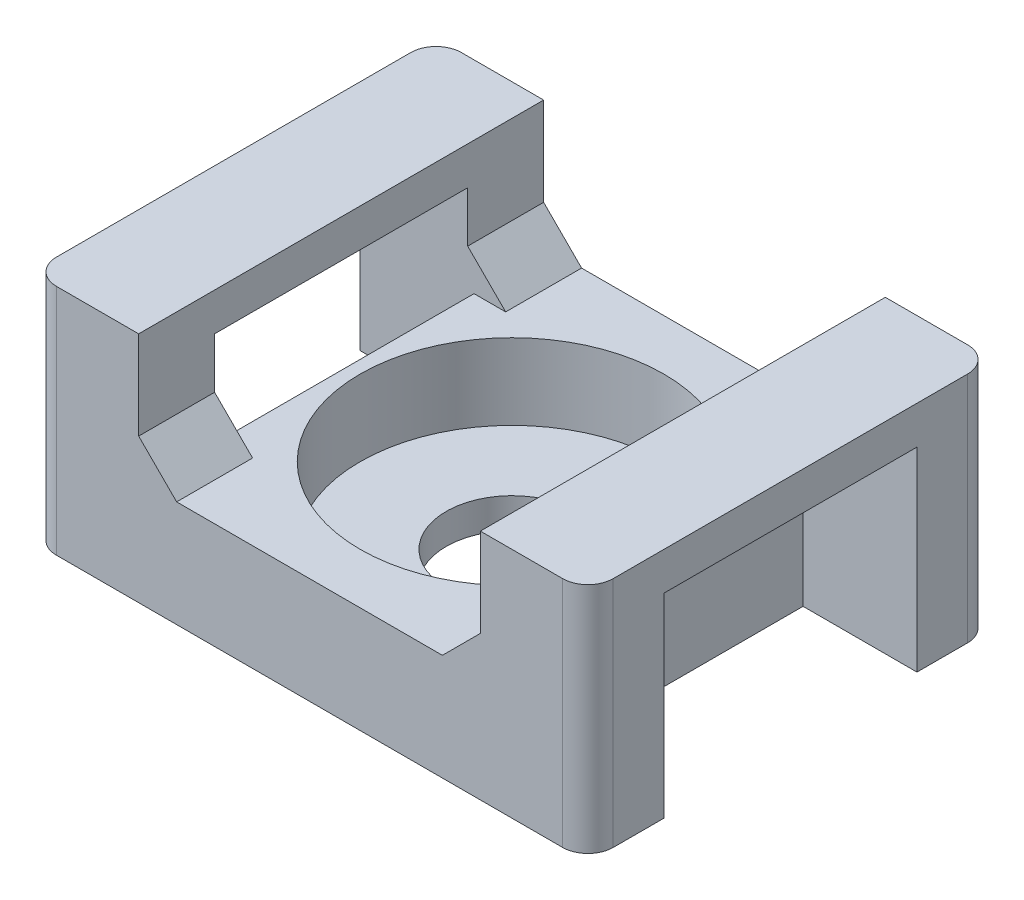
ISO-10303-21;
HEADER;
FILE_DESCRIPTION(('STEP AP214'),'2;1');
FILE_NAME('part.step','',(''),(''),'','','');
FILE_SCHEMA(('AUTOMOTIVE_DESIGN { 1 0 10303 214 1 1 1 1 }'));
ENDSEC;
DATA;
#1=APPLICATION_CONTEXT('core data for automotive mechanical design processes');
#2=APPLICATION_PROTOCOL_DEFINITION('international standard','automotive_design',2000,#1);
#3=PRODUCT_CONTEXT('',#1,'mechanical');
#4=PRODUCT('Part','Part','',(#3));
#5=PRODUCT_RELATED_PRODUCT_CATEGORY('part','',(#4));
#6=PRODUCT_DEFINITION_FORMATION('','',#4);
#7=PRODUCT_DEFINITION_CONTEXT('part definition',#1,'design');
#8=PRODUCT_DEFINITION('design','',#6,#7);
#9=PRODUCT_DEFINITION_SHAPE('','',#8);
#10=(LENGTH_UNIT() NAMED_UNIT(*) SI_UNIT(.MILLI.,.METRE.));
#11=(NAMED_UNIT(*) PLANE_ANGLE_UNIT() SI_UNIT($,.RADIAN.));
#12=(NAMED_UNIT(*) SI_UNIT($,.STERADIAN.) SOLID_ANGLE_UNIT());
#13=UNCERTAINTY_MEASURE_WITH_UNIT(LENGTH_MEASURE(1.E-05),#10,'distance_accuracy_value','');
#14=(GEOMETRIC_REPRESENTATION_CONTEXT(3) GLOBAL_UNCERTAINTY_ASSIGNED_CONTEXT((#13)) GLOBAL_UNIT_ASSIGNED_CONTEXT((#10,
#11,#12)) REPRESENTATION_CONTEXT('',''));
#15=CARTESIAN_POINT('',(0.,0.,0.));
#16=DIRECTION('',(0.,0.,1.));
#17=DIRECTION('',(1.,0.,0.));
#18=AXIS2_PLACEMENT_3D('',#15,#16,#17);
#19=CARTESIAN_POINT('',(-5.25,4.2,8.));
#20=DIRECTION('',(0.,-1.,0.));
#21=DIRECTION('',(1.,0.,0.));
#22=AXIS2_PLACEMENT_3D('',#19,#20,#21);
#23=PLANE('',#22);
#24=DIRECTION('',(-1.,0.,0.));
#25=VECTOR('',#24,1.);
#26=CARTESIAN_POINT('',(-5.25,4.2,-8.));
#27=LINE('',#26,#25);
#28=CARTESIAN_POINT('',(5.25,4.2,-8.));
#29=VERTEX_POINT('',#28);
#30=CARTESIAN_POINT('',(-5.25,4.2,-8.));
#31=VERTEX_POINT('',#30);
#32=EDGE_CURVE('E336',#29,#31,#27,.T.);
#33=ORIENTED_EDGE('',*,*,#32,.T.);
#34=DIRECTION('',(0.,0.,-1.));
#35=VECTOR('',#34,1.);
#36=CARTESIAN_POINT('',(-5.25,4.2,8.));
#37=LINE('',#36,#35);
#38=CARTESIAN_POINT('',(-5.25,4.2,-5.));
#39=VERTEX_POINT('',#38);
#40=EDGE_CURVE('E353',#39,#31,#37,.T.);
#41=ORIENTED_EDGE('',*,*,#40,.F.);
#42=DIRECTION('',(1.,0.,0.));
#43=VECTOR('',#42,1.);
#44=CARTESIAN_POINT('',(-5.25,4.2,-5.));
#45=LINE('',#44,#43);
#46=CARTESIAN_POINT('',(-6.5,4.2,-5.));
#47=VERTEX_POINT('',#46);
#48=EDGE_CURVE('E265',#47,#39,#45,.T.);
#49=ORIENTED_EDGE('',*,*,#48,.F.);
#50=DIRECTION('',(0.,0.,1.));
#51=VECTOR('',#50,1.);
#52=CARTESIAN_POINT('',(-6.5,4.2,-5.));
#53=LINE('',#52,#51);
#54=CARTESIAN_POINT('',(-6.5,4.2,5.));
#55=VERTEX_POINT('',#54);
#56=EDGE_CURVE('E303',#47,#55,#53,.T.);
#57=ORIENTED_EDGE('',*,*,#56,.T.);
#58=DIRECTION('',(1.,0.,0.));
#59=VECTOR('',#58,1.);
#60=CARTESIAN_POINT('',(-5.25,4.2,5.));
#61=LINE('',#60,#59);
#62=CARTESIAN_POINT('',(-5.25,4.2,5.));
#63=VERTEX_POINT('',#62);
#64=EDGE_CURVE('E285',#55,#63,#61,.T.);
#65=ORIENTED_EDGE('',*,*,#64,.T.);
#66=CARTESIAN_POINT('',(-5.25,4.2,8.));
#67=VERTEX_POINT('',#66);
#68=EDGE_CURVE('E354',#67,#63,#37,.T.);
#69=ORIENTED_EDGE('',*,*,#68,.F.);
#70=DIRECTION('',(-1.,0.,0.));
#71=VECTOR('',#70,1.);
#72=CARTESIAN_POINT('',(-5.25,4.2,8.));
#73=LINE('',#72,#71);
#74=CARTESIAN_POINT('',(5.25,4.2,8.));
#75=VERTEX_POINT('',#74);
#76=EDGE_CURVE('E317',#75,#67,#73,.T.);
#77=ORIENTED_EDGE('',*,*,#76,.F.);
#78=DIRECTION('',(0.,0.,-1.));
#79=VECTOR('',#78,1.);
#80=CARTESIAN_POINT('',(5.25,4.2,8.));
#81=LINE('',#80,#79);
#82=CARTESIAN_POINT('',(5.25,4.2,5.));
#83=VERTEX_POINT('',#82);
#84=EDGE_CURVE('E358',#75,#83,#81,.T.);
#85=ORIENTED_EDGE('',*,*,#84,.T.);
#86=DIRECTION('',(-1.,0.,0.));
#87=VECTOR('',#86,1.);
#88=CARTESIAN_POINT('',(5.25,4.2,5.));
#89=LINE('',#88,#87);
#90=CARTESIAN_POINT('',(6.5,4.2,5.));
#91=VERTEX_POINT('',#90);
#92=EDGE_CURVE('E534',#91,#83,#89,.T.);
#93=ORIENTED_EDGE('',*,*,#92,.F.);
#94=DIRECTION('',(0.,0.,1.));
#95=VECTOR('',#94,1.);
#96=CARTESIAN_POINT('',(6.5,4.2,-5.));
#97=LINE('',#96,#95);
#98=CARTESIAN_POINT('',(6.5,4.2,-5.));
#99=VERTEX_POINT('',#98);
#100=EDGE_CURVE('E250',#99,#91,#97,.T.);
#101=ORIENTED_EDGE('',*,*,#100,.F.);
#102=DIRECTION('',(-1.,0.,0.));
#103=VECTOR('',#102,1.);
#104=CARTESIAN_POINT('',(5.25,4.2,-5.));
#105=LINE('',#104,#103);
#106=CARTESIAN_POINT('',(5.25,4.2,-5.));
#107=VERTEX_POINT('',#106);
#108=EDGE_CURVE('E550',#99,#107,#105,.T.);
#109=ORIENTED_EDGE('',*,*,#108,.T.);
#110=EDGE_CURVE('E357',#107,#29,#81,.T.);
#111=ORIENTED_EDGE('',*,*,#110,.T.);
#112=EDGE_LOOP('',(#33,#41,#49,#57,#65,#69,#77,#85,#93,#101,#109,#111));
#113=FACE_BOUND('',#112,.T.);
#114=CARTESIAN_POINT('',(0.,4.2,0.));
#115=DIRECTION('',(0.,1.,0.));
#116=DIRECTION('',(0.,0.,1.));
#117=AXIS2_PLACEMENT_3D('',#114,#115,#116);
#118=CIRCLE('',#117,6.);
#119=CARTESIAN_POINT('',(0.,4.2,6.));
#120=VERTEX_POINT('',#119);
#121=EDGE_CURVE('E564',#120,#120,#118,.T.);
#122=ORIENTED_EDGE('',*,*,#121,.F.);
#123=EDGE_LOOP('',(#122));
#124=FACE_BOUND('',#123,.T.);
#125=ADVANCED_FACE('F35',(#113,#124),#23,.F.);
#126=CARTESIAN_POINT('',(6.75,5.70000000000001,8.));
#127=DIRECTION('',(0.707106781186549,-0.707106781186546,0.));
#128=DIRECTION('',(0.707106781186546,0.707106781186549,0.));
#129=AXIS2_PLACEMENT_3D('',#126,#127,#128);
#130=PLANE('',#129);
#131=DIRECTION('',(0.707106781186546,0.707106781186549,0.));
#132=VECTOR('',#131,1.);
#133=CARTESIAN_POINT('',(6.75,5.70000000000001,5.));
#134=LINE('',#133,#132);
#135=CARTESIAN_POINT('',(6.75,5.70000000000001,5.));
#136=VERTEX_POINT('',#135);
#137=EDGE_CURVE('E440',#83,#136,#134,.T.);
#138=ORIENTED_EDGE('',*,*,#137,.F.);
#139=ORIENTED_EDGE('',*,*,#84,.F.);
#140=DIRECTION('',(-0.707106781186546,-0.707106781186549,0.));
#141=VECTOR('',#140,1.);
#142=CARTESIAN_POINT('',(6.75,5.70000000000001,8.));
#143=LINE('',#142,#141);
#144=CARTESIAN_POINT('',(6.75,5.70000000000001,8.));
#145=VERTEX_POINT('',#144);
#146=EDGE_CURVE('E315',#145,#75,#143,.T.);
#147=ORIENTED_EDGE('',*,*,#146,.F.);
#148=DIRECTION('',(0.,0.,-1.));
#149=VECTOR('',#148,1.);
#150=CARTESIAN_POINT('',(6.75,5.70000000000001,8.));
#151=LINE('',#150,#149);
#152=EDGE_CURVE('E362',#145,#136,#151,.T.);
#153=ORIENTED_EDGE('',*,*,#152,.T.);
#154=EDGE_LOOP('',(#138,#139,#147,#153));
#155=FACE_BOUND('',#154,.T.);
#156=ADVANCED_FACE('F439',(#155),#130,.F.);
#157=CARTESIAN_POINT('',(-6.75,5.70000000000001,8.));
#158=DIRECTION('',(-0.707106781186549,-0.707106781186546,0.));
#159=DIRECTION('',(0.707106781186546,-0.707106781186549,0.));
#160=AXIS2_PLACEMENT_3D('',#157,#158,#159);
#161=PLANE('',#160);
#162=DIRECTION('',(-0.707106781186546,0.707106781186549,0.));
#163=VECTOR('',#162,1.);
#164=CARTESIAN_POINT('',(-6.75,5.70000000000001,5.));
#165=LINE('',#164,#163);
#166=CARTESIAN_POINT('',(-6.75,5.70000000000001,5.));
#167=VERTEX_POINT('',#166);
#168=EDGE_CURVE('E288',#63,#167,#165,.T.);
#169=ORIENTED_EDGE('',*,*,#168,.T.);
#170=DIRECTION('',(0.,0.,-1.));
#171=VECTOR('',#170,1.);
#172=CARTESIAN_POINT('',(-6.75,5.70000000000001,8.));
#173=LINE('',#172,#171);
#174=CARTESIAN_POINT('',(-6.75,5.70000000000001,8.));
#175=VERTEX_POINT('',#174);
#176=EDGE_CURVE('E350',#175,#167,#173,.T.);
#177=ORIENTED_EDGE('',*,*,#176,.F.);
#178=DIRECTION('',(-0.707106781186546,0.707106781186549,0.));
#179=VECTOR('',#178,1.);
#180=CARTESIAN_POINT('',(-6.75,5.70000000000001,8.));
#181=LINE('',#180,#179);
#182=EDGE_CURVE('E319',#67,#175,#181,.T.);
#183=ORIENTED_EDGE('',*,*,#182,.F.);
#184=ORIENTED_EDGE('',*,*,#68,.T.);
#185=EDGE_LOOP('',(#169,#177,#183,#184));
#186=FACE_BOUND('',#185,.T.);
#187=ADVANCED_FACE('F448',(#186),#161,.F.);
#188=CARTESIAN_POINT('',(-11.,0.,8.));
#189=DIRECTION('',(1.,0.,0.));
#190=DIRECTION('',(0.,0.,-1.));
#191=AXIS2_PLACEMENT_3D('',#188,#189,#190);
#192=PLANE('',#191);
#193=DIRECTION('',(0.,0.,-1.));
#194=VECTOR('',#193,1.);
#195=CARTESIAN_POINT('',(-11.,9.2,8.));
#196=LINE('',#195,#194);
#197=CARTESIAN_POINT('',(-11.,9.2,7.));
#198=VERTEX_POINT('',#197);
#199=CARTESIAN_POINT('',(-11.,9.2,-7.));
#200=VERTEX_POINT('',#199);
#201=EDGE_CURVE('E325',#198,#200,#196,.T.);
#202=ORIENTED_EDGE('',*,*,#201,.T.);
#203=DIRECTION('',(0.,-1.,0.));
#204=VECTOR('',#203,1.);
#205=CARTESIAN_POINT('',(-11.,0.,-7.));
#206=LINE('',#205,#204);
#207=CARTESIAN_POINT('',(-11.,0.,-7.));
#208=VERTEX_POINT('',#207);
#209=EDGE_CURVE('E400',#200,#208,#206,.T.);
#210=ORIENTED_EDGE('',*,*,#209,.T.);
#211=DIRECTION('',(0.,0.,-1.));
#212=VECTOR('',#211,1.);
#213=CARTESIAN_POINT('',(-11.,0.,8.));
#214=LINE('',#213,#212);
#215=CARTESIAN_POINT('',(-11.,0.,-5.));
#216=VERTEX_POINT('',#215);
#217=EDGE_CURVE('E374',#216,#208,#214,.T.);
#218=ORIENTED_EDGE('',*,*,#217,.F.);
#219=DIRECTION('',(0.,-1.,0.));
#220=VECTOR('',#219,1.);
#221=CARTESIAN_POINT('',(-11.,0.,-5.));
#222=LINE('',#221,#220);
#223=CARTESIAN_POINT('',(-11.,7.7,-5.));
#224=VERTEX_POINT('',#223);
#225=EDGE_CURVE('E256',#224,#216,#222,.T.);
#226=ORIENTED_EDGE('',*,*,#225,.F.);
#227=DIRECTION('',(0.,0.,1.));
#228=VECTOR('',#227,1.);
#229=CARTESIAN_POINT('',(-11.,7.7,-5.));
#230=LINE('',#229,#228);
#231=CARTESIAN_POINT('',(-11.,7.7,5.));
#232=VERTEX_POINT('',#231);
#233=EDGE_CURVE('E296',#224,#232,#230,.T.);
#234=ORIENTED_EDGE('',*,*,#233,.T.);
#235=DIRECTION('',(0.,-1.,0.));
#236=VECTOR('',#235,1.);
#237=CARTESIAN_POINT('',(-11.,0.,5.));
#238=LINE('',#237,#236);
#239=CARTESIAN_POINT('',(-11.,0.,5.));
#240=VERTEX_POINT('',#239);
#241=EDGE_CURVE('E275',#232,#240,#238,.T.);
#242=ORIENTED_EDGE('',*,*,#241,.T.);
#243=CARTESIAN_POINT('',(-11.,0.,7.));
#244=VERTEX_POINT('',#243);
#245=EDGE_CURVE('E375',#244,#240,#214,.T.);
#246=ORIENTED_EDGE('',*,*,#245,.F.);
#247=DIRECTION('',(0.,-1.,0.));
#248=VECTOR('',#247,1.);
#249=CARTESIAN_POINT('',(-11.,0.,7.));
#250=LINE('',#249,#248);
#251=EDGE_CURVE('E398',#244,#198,#250,.F.);
#252=ORIENTED_EDGE('',*,*,#251,.T.);
#253=EDGE_LOOP('',(#202,#210,#218,#226,#234,#242,#246,#252));
#254=FACE_BOUND('',#253,.T.);
#255=ADVANCED_FACE('F487',(#254),#192,.F.);
#256=CARTESIAN_POINT('',(11.,0.,8.));
#257=DIRECTION('',(0.,1.,0.));
#258=DIRECTION('',(0.,0.,1.));
#259=AXIS2_PLACEMENT_3D('',#256,#257,#258);
#260=PLANE('',#259);
#261=CARTESIAN_POINT('',(0.,0.,0.));
#262=DIRECTION('',(0.,1.,0.));
#263=DIRECTION('',(0.,0.,1.));
#264=AXIS2_PLACEMENT_3D('',#261,#262,#263);
#265=CIRCLE('',#264,2.6);
#266=CARTESIAN_POINT('',(0.,0.,2.6));
#267=VERTEX_POINT('',#266);
#268=EDGE_CURVE('E529',#267,#267,#265,.T.);
#269=ORIENTED_EDGE('',*,*,#268,.T.);
#270=EDGE_LOOP('',(#269));
#271=FACE_BOUND('',#270,.T.);
#272=DIRECTION('',(1.,0.,0.));
#273=VECTOR('',#272,1.);
#274=CARTESIAN_POINT('',(11.,0.,-8.));
#275=LINE('',#274,#273);
#276=CARTESIAN_POINT('',(-10.,0.,-8.));
#277=VERTEX_POINT('',#276);
#278=CARTESIAN_POINT('',(10.,0.,-8.));
#279=VERTEX_POINT('',#278);
#280=EDGE_CURVE('E299',#277,#279,#275,.T.);
#281=ORIENTED_EDGE('',*,*,#280,.T.);
#282=CARTESIAN_POINT('',(10.,0.,-7.));
#283=DIRECTION('',(0.,1.,0.));
#284=DIRECTION('',(0.,0.,1.));
#285=AXIS2_PLACEMENT_3D('',#282,#283,#284);
#286=CIRCLE('',#285,1.);
#287=CARTESIAN_POINT('',(11.,0.,-7.));
#288=VERTEX_POINT('',#287);
#289=EDGE_CURVE('E396',#279,#288,#286,.F.);
#290=ORIENTED_EDGE('',*,*,#289,.T.);
#291=DIRECTION('',(0.,0.,-1.));
#292=VECTOR('',#291,1.);
#293=CARTESIAN_POINT('',(11.,0.,8.));
#294=LINE('',#293,#292);
#295=CARTESIAN_POINT('',(11.,0.,-5.));
#296=VERTEX_POINT('',#295);
#297=EDGE_CURVE('E371',#296,#288,#294,.T.);
#298=ORIENTED_EDGE('',*,*,#297,.F.);
#299=DIRECTION('',(-1.,0.,0.));
#300=VECTOR('',#299,1.);
#301=CARTESIAN_POINT('',(6.5,0.,-5.));
#302=LINE('',#301,#300);
#303=CARTESIAN_POINT('',(6.5,0.,-5.));
#304=VERTEX_POINT('',#303);
#305=EDGE_CURVE('E239',#296,#304,#302,.T.);
#306=ORIENTED_EDGE('',*,*,#305,.T.);
#307=DIRECTION('',(0.,0.,1.));
#308=VECTOR('',#307,1.);
#309=CARTESIAN_POINT('',(6.5,0.,-5.));
#310=LINE('',#309,#308);
#311=CARTESIAN_POINT('',(6.5,0.,5.));
#312=VERTEX_POINT('',#311);
#313=EDGE_CURVE('E279',#304,#312,#310,.T.);
#314=ORIENTED_EDGE('',*,*,#313,.T.);
#315=DIRECTION('',(-1.,0.,0.));
#316=VECTOR('',#315,1.);
#317=CARTESIAN_POINT('',(6.5,0.,5.));
#318=LINE('',#317,#316);
#319=CARTESIAN_POINT('',(11.,0.,5.));
#320=VERTEX_POINT('',#319);
#321=EDGE_CURVE('E243',#320,#312,#318,.T.);
#322=ORIENTED_EDGE('',*,*,#321,.F.);
#323=CARTESIAN_POINT('',(11.,0.,7.));
#324=VERTEX_POINT('',#323);
#325=EDGE_CURVE('E372',#324,#320,#294,.T.);
#326=ORIENTED_EDGE('',*,*,#325,.F.);
#327=CARTESIAN_POINT('',(10.,0.,7.));
#328=DIRECTION('',(0.,1.,0.));
#329=DIRECTION('',(0.,0.,1.));
#330=AXIS2_PLACEMENT_3D('',#327,#328,#329);
#331=CIRCLE('',#330,1.);
#332=CARTESIAN_POINT('',(10.,0.,8.));
#333=VERTEX_POINT('',#332);
#334=EDGE_CURVE('E392',#324,#333,#331,.F.);
#335=ORIENTED_EDGE('',*,*,#334,.T.);
#336=DIRECTION('',(1.,0.,0.));
#337=VECTOR('',#336,1.);
#338=CARTESIAN_POINT('',(11.,0.,8.));
#339=LINE('',#338,#337);
#340=CARTESIAN_POINT('',(-10.,0.,8.));
#341=VERTEX_POINT('',#340);
#342=EDGE_CURVE('E307',#341,#333,#339,.T.);
#343=ORIENTED_EDGE('',*,*,#342,.F.);
#344=CARTESIAN_POINT('',(-10.,0.,7.));
#345=DIRECTION('',(0.,1.,0.));
#346=DIRECTION('',(0.,0.,1.));
#347=AXIS2_PLACEMENT_3D('',#344,#345,#346);
#348=CIRCLE('',#347,1.);
#349=EDGE_CURVE('E390',#341,#244,#348,.F.);
#350=ORIENTED_EDGE('',*,*,#349,.T.);
#351=ORIENTED_EDGE('',*,*,#245,.T.);
#352=DIRECTION('',(1.,0.,0.));
#353=VECTOR('',#352,1.);
#354=CARTESIAN_POINT('',(-6.5,0.,5.));
#355=LINE('',#354,#353);
#356=CARTESIAN_POINT('',(-6.5,0.,5.));
#357=VERTEX_POINT('',#356);
#358=EDGE_CURVE('E278',#240,#357,#355,.T.);
#359=ORIENTED_EDGE('',*,*,#358,.T.);
#360=DIRECTION('',(0.,0.,1.));
#361=VECTOR('',#360,1.);
#362=CARTESIAN_POINT('',(-6.5,0.,-5.));
#363=LINE('',#362,#361);
#364=CARTESIAN_POINT('',(-6.5,0.,-5.));
#365=VERTEX_POINT('',#364);
#366=EDGE_CURVE('E274',#365,#357,#363,.T.);
#367=ORIENTED_EDGE('',*,*,#366,.F.);
#368=DIRECTION('',(1.,0.,0.));
#369=VECTOR('',#368,1.);
#370=CARTESIAN_POINT('',(-6.5,0.,-5.));
#371=LINE('',#370,#369);
#372=EDGE_CURVE('E258',#216,#365,#371,.T.);
#373=ORIENTED_EDGE('',*,*,#372,.F.);
#374=ORIENTED_EDGE('',*,*,#217,.T.);
#375=CARTESIAN_POINT('',(-10.,0.,-7.));
#376=DIRECTION('',(0.,1.,0.));
#377=DIRECTION('',(0.,0.,1.));
#378=AXIS2_PLACEMENT_3D('',#375,#376,#377);
#379=CIRCLE('',#378,1.);
#380=EDGE_CURVE('E394',#208,#277,#379,.F.);
#381=ORIENTED_EDGE('',*,*,#380,.T.);
#382=EDGE_LOOP('',(#281,#290,#298,#306,#314,#322,#326,#335,#343,#350,#351,#359,#367,#373,#374,#381));
#383=FACE_BOUND('',#382,.T.);
#384=ADVANCED_FACE('F412',(#271,#383),#260,.F.);
#385=CARTESIAN_POINT('',(11.,0.,8.));
#386=DIRECTION('',(-1.,0.,0.));
#387=DIRECTION('',(0.,0.,1.));
#388=AXIS2_PLACEMENT_3D('',#385,#386,#387);
#389=PLANE('',#388);
#390=ORIENTED_EDGE('',*,*,#297,.T.);
#391=DIRECTION('',(0.,1.,0.));
#392=VECTOR('',#391,1.);
#393=CARTESIAN_POINT('',(11.,9.2,-7.));
#394=LINE('',#393,#392);
#395=CARTESIAN_POINT('',(11.,9.2,-7.));
#396=VERTEX_POINT('',#395);
#397=EDGE_CURVE('E379',#288,#396,#394,.T.);
#398=ORIENTED_EDGE('',*,*,#397,.T.);
#399=DIRECTION('',(0.,0.,-1.));
#400=VECTOR('',#399,1.);
#401=CARTESIAN_POINT('',(11.,9.2,8.));
#402=LINE('',#401,#400);
#403=CARTESIAN_POINT('',(11.,9.2,7.));
#404=VERTEX_POINT('',#403);
#405=EDGE_CURVE('E368',#404,#396,#402,.T.);
#406=ORIENTED_EDGE('',*,*,#405,.F.);
#407=DIRECTION('',(0.,1.,0.));
#408=VECTOR('',#407,1.);
#409=CARTESIAN_POINT('',(11.,0.,7.));
#410=LINE('',#409,#408);
#411=EDGE_CURVE('E377',#404,#324,#410,.F.);
#412=ORIENTED_EDGE('',*,*,#411,.T.);
#413=ORIENTED_EDGE('',*,*,#325,.T.);
#414=DIRECTION('',(0.,-1.,0.));
#415=VECTOR('',#414,1.);
#416=CARTESIAN_POINT('',(11.,0.,5.));
#417=LINE('',#416,#415);
#418=CARTESIAN_POINT('',(11.,7.7,5.));
#419=VERTEX_POINT('',#418);
#420=EDGE_CURVE('E248',#419,#320,#417,.T.);
#421=ORIENTED_EDGE('',*,*,#420,.F.);
#422=DIRECTION('',(0.,0.,1.));
#423=VECTOR('',#422,1.);
#424=CARTESIAN_POINT('',(11.,7.7,-5.));
#425=LINE('',#424,#423);
#426=CARTESIAN_POINT('',(11.,7.7,-5.));
#427=VERTEX_POINT('',#426);
#428=EDGE_CURVE('E226',#427,#419,#425,.T.);
#429=ORIENTED_EDGE('',*,*,#428,.F.);
#430=DIRECTION('',(0.,-1.,0.));
#431=VECTOR('',#430,1.);
#432=CARTESIAN_POINT('',(11.,0.,-5.));
#433=LINE('',#432,#431);
#434=EDGE_CURVE('E233',#427,#296,#433,.T.);
#435=ORIENTED_EDGE('',*,*,#434,.T.);
#436=EDGE_LOOP('',(#390,#398,#406,#412,#413,#421,#429,#435));
#437=FACE_BOUND('',#436,.T.);
#438=ADVANCED_FACE('F246',(#437),#389,.F.);
#439=CARTESIAN_POINT('',(11.,9.2,8.));
#440=DIRECTION('',(0.,-1.,0.));
#441=DIRECTION('',(1.,0.,0.));
#442=AXIS2_PLACEMENT_3D('',#439,#440,#441);
#443=PLANE('',#442);
#444=ORIENTED_EDGE('',*,*,#405,.T.);
#445=CARTESIAN_POINT('',(10.,9.2,-7.));
#446=DIRECTION('',(0.,-1.,0.));
#447=DIRECTION('',(1.,0.,0.));
#448=AXIS2_PLACEMENT_3D('',#445,#446,#447);
#449=CIRCLE('',#448,1.);
#450=CARTESIAN_POINT('',(10.,9.2,-8.));
#451=VERTEX_POINT('',#450);
#452=EDGE_CURVE('E384',#396,#451,#449,.F.);
#453=ORIENTED_EDGE('',*,*,#452,.T.);
#454=DIRECTION('',(-1.,0.,0.));
#455=VECTOR('',#454,1.);
#456=CARTESIAN_POINT('',(11.,9.2,-8.));
#457=LINE('',#456,#455);
#458=CARTESIAN_POINT('',(6.75,9.2,-8.));
#459=VERTEX_POINT('',#458);
#460=EDGE_CURVE('E328',#451,#459,#457,.T.);
#461=ORIENTED_EDGE('',*,*,#460,.T.);
#462=DIRECTION('',(0.,0.,-1.));
#463=VECTOR('',#462,1.);
#464=CARTESIAN_POINT('',(6.75,9.2,8.));
#465=LINE('',#464,#463);
#466=CARTESIAN_POINT('',(6.75,9.2,8.));
#467=VERTEX_POINT('',#466);
#468=EDGE_CURVE('E365',#467,#459,#465,.T.);
#469=ORIENTED_EDGE('',*,*,#468,.F.);
#470=DIRECTION('',(-1.,0.,0.));
#471=VECTOR('',#470,1.);
#472=CARTESIAN_POINT('',(11.,9.2,8.));
#473=LINE('',#472,#471);
#474=CARTESIAN_POINT('',(10.,9.2,8.));
#475=VERTEX_POINT('',#474);
#476=EDGE_CURVE('E310',#475,#467,#473,.T.);
#477=ORIENTED_EDGE('',*,*,#476,.F.);
#478=CARTESIAN_POINT('',(10.,9.2,7.));
#479=DIRECTION('',(0.,-1.,0.));
#480=DIRECTION('',(1.,0.,0.));
#481=AXIS2_PLACEMENT_3D('',#478,#479,#480);
#482=CIRCLE('',#481,1.);
#483=EDGE_CURVE('E382',#475,#404,#482,.F.);
#484=ORIENTED_EDGE('',*,*,#483,.T.);
#485=EDGE_LOOP('',(#444,#453,#461,#469,#477,#484));
#486=FACE_BOUND('',#485,.T.);
#487=ADVANCED_FACE('F423',(#486),#443,.F.);
#488=CARTESIAN_POINT('',(6.75,9.2,8.));
#489=DIRECTION('',(1.,0.,0.));
#490=DIRECTION('',(0.,1.,0.));
#491=AXIS2_PLACEMENT_3D('',#488,#489,#490);
#492=PLANE('',#491);
#493=CARTESIAN_POINT('',(6.75,5.70000000000001,-5.));
#494=VERTEX_POINT('',#493);
#495=CARTESIAN_POINT('',(6.75,5.70000000000001,-8.));
#496=VERTEX_POINT('',#495);
#497=EDGE_CURVE('E361',#494,#496,#151,.T.);
#498=ORIENTED_EDGE('',*,*,#497,.F.);
#499=DIRECTION('',(0.,1.,0.));
#500=VECTOR('',#499,1.);
#501=CARTESIAN_POINT('',(6.75,7.7,-5.));
#502=LINE('',#501,#500);
#503=CARTESIAN_POINT('',(6.75,7.7,-5.));
#504=VERTEX_POINT('',#503);
#505=EDGE_CURVE('E232',#494,#504,#502,.T.);
#506=ORIENTED_EDGE('',*,*,#505,.T.);
#507=DIRECTION('',(0.,0.,1.));
#508=VECTOR('',#507,1.);
#509=CARTESIAN_POINT('',(6.75,7.7,-5.));
#510=LINE('',#509,#508);
#511=CARTESIAN_POINT('',(6.75,7.7,5.));
#512=VERTEX_POINT('',#511);
#513=EDGE_CURVE('E229',#504,#512,#510,.T.);
#514=ORIENTED_EDGE('',*,*,#513,.T.);
#515=DIRECTION('',(0.,1.,0.));
#516=VECTOR('',#515,1.);
#517=CARTESIAN_POINT('',(6.75,7.7,5.));
#518=LINE('',#517,#516);
#519=EDGE_CURVE('E544',#136,#512,#518,.T.);
#520=ORIENTED_EDGE('',*,*,#519,.F.);
#521=ORIENTED_EDGE('',*,*,#152,.F.);
#522=DIRECTION('',(0.,-1.,0.));
#523=VECTOR('',#522,1.);
#524=CARTESIAN_POINT('',(6.75,9.2,8.));
#525=LINE('',#524,#523);
#526=EDGE_CURVE('E313',#467,#145,#525,.T.);
#527=ORIENTED_EDGE('',*,*,#526,.F.);
#528=ORIENTED_EDGE('',*,*,#468,.T.);
#529=DIRECTION('',(0.,-1.,0.));
#530=VECTOR('',#529,1.);
#531=CARTESIAN_POINT('',(6.75,9.2,-8.));
#532=LINE('',#531,#530);
#533=EDGE_CURVE('E330',#459,#496,#532,.T.);
#534=ORIENTED_EDGE('',*,*,#533,.T.);
#535=EDGE_LOOP('',(#498,#506,#514,#520,#521,#527,#528,#534));
#536=FACE_BOUND('',#535,.T.);
#537=ADVANCED_FACE('F431',(#536),#492,.F.);
#538=ORIENTED_EDGE('',*,*,#110,.F.);
#539=DIRECTION('',(0.707106781186546,0.707106781186549,0.));
#540=VECTOR('',#539,1.);
#541=CARTESIAN_POINT('',(6.75,5.70000000000001,-5.));
#542=LINE('',#541,#540);
#543=EDGE_CURVE('E552',#107,#494,#542,.T.);
#544=ORIENTED_EDGE('',*,*,#543,.T.);
#545=ORIENTED_EDGE('',*,*,#497,.T.);
#546=DIRECTION('',(-0.707106781186546,-0.707106781186549,0.));
#547=VECTOR('',#546,1.);
#548=CARTESIAN_POINT('',(6.75,5.70000000000001,-8.));
#549=LINE('',#548,#547);
#550=EDGE_CURVE('E333',#496,#29,#549,.T.);
#551=ORIENTED_EDGE('',*,*,#550,.T.);
#552=EDGE_LOOP('',(#538,#544,#545,#551));
#553=FACE_BOUND('',#552,.T.);
#554=ADVANCED_FACE('F474',(#553),#130,.F.);
#555=CARTESIAN_POINT('',(-6.75,5.70000000000001,-5.));
#556=VERTEX_POINT('',#555);
#557=CARTESIAN_POINT('',(-6.75,5.70000000000001,-8.));
#558=VERTEX_POINT('',#557);
#559=EDGE_CURVE('E349',#556,#558,#173,.T.);
#560=ORIENTED_EDGE('',*,*,#559,.F.);
#561=DIRECTION('',(-0.707106781186546,0.707106781186549,0.));
#562=VECTOR('',#561,1.);
#563=CARTESIAN_POINT('',(-6.75,5.70000000000001,-5.));
#564=LINE('',#563,#562);
#565=EDGE_CURVE('E267',#39,#556,#564,.T.);
#566=ORIENTED_EDGE('',*,*,#565,.F.);
#567=ORIENTED_EDGE('',*,*,#40,.T.);
#568=DIRECTION('',(-0.707106781186546,0.707106781186549,0.));
#569=VECTOR('',#568,1.);
#570=CARTESIAN_POINT('',(-6.75,5.70000000000001,-8.));
#571=LINE('',#570,#569);
#572=EDGE_CURVE('E339',#31,#558,#571,.T.);
#573=ORIENTED_EDGE('',*,*,#572,.T.);
#574=EDGE_LOOP('',(#560,#566,#567,#573));
#575=FACE_BOUND('',#574,.T.);
#576=ADVANCED_FACE('F465',(#575),#161,.F.);
#577=CARTESIAN_POINT('',(-6.75,9.2,8.));
#578=DIRECTION('',(-1.,0.,0.));
#579=DIRECTION('',(0.,0.,1.));
#580=AXIS2_PLACEMENT_3D('',#577,#578,#579);
#581=PLANE('',#580);
#582=DIRECTION('',(0.,0.,1.));
#583=VECTOR('',#582,1.);
#584=CARTESIAN_POINT('',(-6.75,7.7,-5.));
#585=LINE('',#584,#583);
#586=CARTESIAN_POINT('',(-6.75,7.7,-5.));
#587=VERTEX_POINT('',#586);
#588=CARTESIAN_POINT('',(-6.75,7.7,5.));
#589=VERTEX_POINT('',#588);
#590=EDGE_CURVE('E300',#587,#589,#585,.T.);
#591=ORIENTED_EDGE('',*,*,#590,.F.);
#592=DIRECTION('',(0.,1.,0.));
#593=VECTOR('',#592,1.);
#594=CARTESIAN_POINT('',(-6.75,7.7,-5.));
#595=LINE('',#594,#593);
#596=EDGE_CURVE('E269',#556,#587,#595,.T.);
#597=ORIENTED_EDGE('',*,*,#596,.F.);
#598=ORIENTED_EDGE('',*,*,#559,.T.);
#599=DIRECTION('',(0.,1.,0.));
#600=VECTOR('',#599,1.);
#601=CARTESIAN_POINT('',(-6.75,9.2,-8.));
#602=LINE('',#601,#600);
#603=CARTESIAN_POINT('',(-6.75,9.2,-8.));
#604=VERTEX_POINT('',#603);
#605=EDGE_CURVE('E342',#558,#604,#602,.T.);
#606=ORIENTED_EDGE('',*,*,#605,.T.);
#607=DIRECTION('',(0.,0.,-1.));
#608=VECTOR('',#607,1.);
#609=CARTESIAN_POINT('',(-6.75,9.2,8.));
#610=LINE('',#609,#608);
#611=CARTESIAN_POINT('',(-6.75,9.2,8.));
#612=VERTEX_POINT('',#611);
#613=EDGE_CURVE('E346',#612,#604,#610,.T.);
#614=ORIENTED_EDGE('',*,*,#613,.F.);
#615=DIRECTION('',(0.,1.,0.));
#616=VECTOR('',#615,1.);
#617=CARTESIAN_POINT('',(-6.75,9.2,8.));
#618=LINE('',#617,#616);
#619=EDGE_CURVE('E321',#175,#612,#618,.T.);
#620=ORIENTED_EDGE('',*,*,#619,.F.);
#621=ORIENTED_EDGE('',*,*,#176,.T.);
#622=DIRECTION('',(0.,1.,0.));
#623=VECTOR('',#622,1.);
#624=CARTESIAN_POINT('',(-6.75,7.7,5.));
#625=LINE('',#624,#623);
#626=EDGE_CURVE('E291',#167,#589,#625,.T.);
#627=ORIENTED_EDGE('',*,*,#626,.T.);
#628=EDGE_LOOP('',(#591,#597,#598,#606,#614,#620,#621,#627));
#629=FACE_BOUND('',#628,.T.);
#630=ADVANCED_FACE('F453',(#629),#581,.F.);
#631=CARTESIAN_POINT('',(-11.,9.2,8.));
#632=DIRECTION('',(0.,-1.,0.));
#633=DIRECTION('',(0.,0.,-1.));
#634=AXIS2_PLACEMENT_3D('',#631,#632,#633);
#635=PLANE('',#634);
#636=DIRECTION('',(-1.,0.,0.));
#637=VECTOR('',#636,1.);
#638=CARTESIAN_POINT('',(-11.,9.2,-8.));
#639=LINE('',#638,#637);
#640=CARTESIAN_POINT('',(-10.,9.2,-8.));
#641=VERTEX_POINT('',#640);
#642=EDGE_CURVE('E311',#604,#641,#639,.T.);
#643=ORIENTED_EDGE('',*,*,#642,.T.);
#644=CARTESIAN_POINT('',(-10.,9.2,-7.));
#645=DIRECTION('',(0.,-1.,0.));
#646=DIRECTION('',(0.,0.,-1.));
#647=AXIS2_PLACEMENT_3D('',#644,#645,#646);
#648=CIRCLE('',#647,1.);
#649=EDGE_CURVE('E56',#641,#200,#648,.F.);
#650=ORIENTED_EDGE('',*,*,#649,.T.);
#651=ORIENTED_EDGE('',*,*,#201,.F.);
#652=CARTESIAN_POINT('',(-10.,9.2,7.));
#653=DIRECTION('',(0.,-1.,0.));
#654=DIRECTION('',(0.,0.,-1.));
#655=AXIS2_PLACEMENT_3D('',#652,#653,#654);
#656=CIRCLE('',#655,1.);
#657=CARTESIAN_POINT('',(-10.,9.2,8.));
#658=VERTEX_POINT('',#657);
#659=EDGE_CURVE('E50',#198,#658,#656,.F.);
#660=ORIENTED_EDGE('',*,*,#659,.T.);
#661=DIRECTION('',(-1.,0.,0.));
#662=VECTOR('',#661,1.);
#663=CARTESIAN_POINT('',(-11.,9.2,8.));
#664=LINE('',#663,#662);
#665=EDGE_CURVE('E323',#612,#658,#664,.T.);
#666=ORIENTED_EDGE('',*,*,#665,.F.);
#667=ORIENTED_EDGE('',*,*,#613,.T.);
#668=EDGE_LOOP('',(#643,#650,#651,#660,#666,#667));
#669=FACE_BOUND('',#668,.T.);
#670=ADVANCED_FACE('F456',(#669),#635,.F.);
#671=CARTESIAN_POINT('',(0.,0.,8.));
#672=DIRECTION('',(0.,0.,-1.));
#673=DIRECTION('',(-1.,0.,0.));
#674=AXIS2_PLACEMENT_3D('',#671,#672,#673);
#675=PLANE('',#674);
#676=ORIENTED_EDGE('',*,*,#342,.T.);
#677=DIRECTION('',(0.,1.,0.));
#678=VECTOR('',#677,1.);
#679=CARTESIAN_POINT('',(10.,0.,8.));
#680=LINE('',#679,#678);
#681=EDGE_CURVE('E11',#333,#475,#680,.T.);
#682=ORIENTED_EDGE('',*,*,#681,.T.);
#683=ORIENTED_EDGE('',*,*,#476,.T.);
#684=ORIENTED_EDGE('',*,*,#526,.T.);
#685=ORIENTED_EDGE('',*,*,#146,.T.);
#686=ORIENTED_EDGE('',*,*,#76,.T.);
#687=ORIENTED_EDGE('',*,*,#182,.T.);
#688=ORIENTED_EDGE('',*,*,#619,.T.);
#689=ORIENTED_EDGE('',*,*,#665,.T.);
#690=DIRECTION('',(0.,-1.,0.));
#691=VECTOR('',#690,1.);
#692=CARTESIAN_POINT('',(-10.,0.,8.));
#693=LINE('',#692,#691);
#694=EDGE_CURVE('E43',#658,#341,#693,.T.);
#695=ORIENTED_EDGE('',*,*,#694,.T.);
#696=EDGE_LOOP('',(#676,#682,#683,#684,#685,#686,#687,#688,#689,#695));
#697=FACE_BOUND('',#696,.T.);
#698=ADVANCED_FACE('F408',(#697),#675,.F.);
#699=CARTESIAN_POINT('',(0.,0.,-8.));
#700=DIRECTION('',(0.,0.,-1.));
#701=DIRECTION('',(-1.,0.,0.));
#702=AXIS2_PLACEMENT_3D('',#699,#700,#701);
#703=PLANE('',#702);
#704=ORIENTED_EDGE('',*,*,#460,.F.);
#705=DIRECTION('',(0.,1.,0.));
#706=VECTOR('',#705,1.);
#707=CARTESIAN_POINT('',(10.,0.,-8.));
#708=LINE('',#707,#706);
#709=EDGE_CURVE('E388',#451,#279,#708,.F.);
#710=ORIENTED_EDGE('',*,*,#709,.T.);
#711=ORIENTED_EDGE('',*,*,#280,.F.);
#712=DIRECTION('',(0.,-1.,0.));
#713=VECTOR('',#712,1.);
#714=CARTESIAN_POINT('',(-10.,9.2,-8.));
#715=LINE('',#714,#713);
#716=EDGE_CURVE('E386',#277,#641,#715,.F.);
#717=ORIENTED_EDGE('',*,*,#716,.T.);
#718=ORIENTED_EDGE('',*,*,#642,.F.);
#719=ORIENTED_EDGE('',*,*,#605,.F.);
#720=ORIENTED_EDGE('',*,*,#572,.F.);
#721=ORIENTED_EDGE('',*,*,#32,.F.);
#722=ORIENTED_EDGE('',*,*,#550,.F.);
#723=ORIENTED_EDGE('',*,*,#533,.F.);
#724=EDGE_LOOP('',(#704,#710,#711,#717,#718,#719,#720,#721,#722,#723));
#725=FACE_BOUND('',#724,.T.);
#726=ADVANCED_FACE('F463',(#725),#703,.T.);
#727=CARTESIAN_POINT('',(-11.,7.7,-5.));
#728=DIRECTION('',(0.,1.,0.));
#729=DIRECTION('',(0.,0.,1.));
#730=AXIS2_PLACEMENT_3D('',#727,#728,#729);
#731=PLANE('',#730);
#732=DIRECTION('',(-1.,0.,0.));
#733=VECTOR('',#732,1.);
#734=CARTESIAN_POINT('',(-11.,7.7,5.));
#735=LINE('',#734,#733);
#736=EDGE_CURVE('E259',#589,#232,#735,.T.);
#737=ORIENTED_EDGE('',*,*,#736,.T.);
#738=ORIENTED_EDGE('',*,*,#233,.F.);
#739=DIRECTION('',(-1.,0.,0.));
#740=VECTOR('',#739,1.);
#741=CARTESIAN_POINT('',(-11.,7.7,-5.));
#742=LINE('',#741,#740);
#743=EDGE_CURVE('E271',#587,#224,#742,.T.);
#744=ORIENTED_EDGE('',*,*,#743,.F.);
#745=ORIENTED_EDGE('',*,*,#590,.T.);
#746=EDGE_LOOP('',(#737,#738,#744,#745));
#747=FACE_BOUND('',#746,.T.);
#748=ADVANCED_FACE('F596',(#747),#731,.F.);
#749=CARTESIAN_POINT('',(-6.5,4.2,-5.));
#750=DIRECTION('',(1.,0.,0.));
#751=DIRECTION('',(0.,1.,0.));
#752=AXIS2_PLACEMENT_3D('',#749,#750,#751);
#753=PLANE('',#752);
#754=DIRECTION('',(0.,1.,0.));
#755=VECTOR('',#754,1.);
#756=CARTESIAN_POINT('',(-6.5,4.2,5.));
#757=LINE('',#756,#755);
#758=EDGE_CURVE('E282',#357,#55,#757,.T.);
#759=ORIENTED_EDGE('',*,*,#758,.T.);
#760=ORIENTED_EDGE('',*,*,#56,.F.);
#761=DIRECTION('',(0.,1.,0.));
#762=VECTOR('',#761,1.);
#763=CARTESIAN_POINT('',(-6.5,4.2,-5.));
#764=LINE('',#763,#762);
#765=EDGE_CURVE('E262',#365,#47,#764,.T.);
#766=ORIENTED_EDGE('',*,*,#765,.F.);
#767=ORIENTED_EDGE('',*,*,#366,.T.);
#768=EDGE_LOOP('',(#759,#760,#766,#767));
#769=FACE_BOUND('',#768,.T.);
#770=ADVANCED_FACE('F513',(#769),#753,.F.);
#771=CARTESIAN_POINT('',(0.,0.,-5.));
#772=DIRECTION('',(0.,0.,-1.));
#773=DIRECTION('',(-1.,0.,0.));
#774=AXIS2_PLACEMENT_3D('',#771,#772,#773);
#775=PLANE('',#774);
#776=ORIENTED_EDGE('',*,*,#225,.T.);
#777=ORIENTED_EDGE('',*,*,#372,.T.);
#778=ORIENTED_EDGE('',*,*,#765,.T.);
#779=ORIENTED_EDGE('',*,*,#48,.T.);
#780=ORIENTED_EDGE('',*,*,#565,.T.);
#781=ORIENTED_EDGE('',*,*,#596,.T.);
#782=ORIENTED_EDGE('',*,*,#743,.T.);
#783=EDGE_LOOP('',(#776,#777,#778,#779,#780,#781,#782));
#784=FACE_BOUND('',#783,.T.);
#785=ADVANCED_FACE('F591',(#784),#775,.F.);
#786=CARTESIAN_POINT('',(0.,0.,5.));
#787=DIRECTION('',(0.,0.,-1.));
#788=DIRECTION('',(-1.,0.,0.));
#789=AXIS2_PLACEMENT_3D('',#786,#787,#788);
#790=PLANE('',#789);
#791=ORIENTED_EDGE('',*,*,#241,.F.);
#792=ORIENTED_EDGE('',*,*,#736,.F.);
#793=ORIENTED_EDGE('',*,*,#626,.F.);
#794=ORIENTED_EDGE('',*,*,#168,.F.);
#795=ORIENTED_EDGE('',*,*,#64,.F.);
#796=ORIENTED_EDGE('',*,*,#758,.F.);
#797=ORIENTED_EDGE('',*,*,#358,.F.);
#798=EDGE_LOOP('',(#791,#792,#793,#794,#795,#796,#797));
#799=FACE_BOUND('',#798,.T.);
#800=ADVANCED_FACE('F511',(#799),#790,.T.);
#801=CARTESIAN_POINT('',(6.5,4.2,-5.));
#802=DIRECTION('',(1.,0.,0.));
#803=DIRECTION('',(0.,1.,0.));
#804=AXIS2_PLACEMENT_3D('',#801,#802,#803);
#805=PLANE('',#804);
#806=DIRECTION('',(0.,1.,0.));
#807=VECTOR('',#806,1.);
#808=CARTESIAN_POINT('',(6.5,4.2,5.));
#809=LINE('',#808,#807);
#810=EDGE_CURVE('E532',#312,#91,#809,.T.);
#811=ORIENTED_EDGE('',*,*,#810,.F.);
#812=ORIENTED_EDGE('',*,*,#313,.F.);
#813=DIRECTION('',(0.,1.,0.));
#814=VECTOR('',#813,1.);
#815=CARTESIAN_POINT('',(6.5,4.2,-5.));
#816=LINE('',#815,#814);
#817=EDGE_CURVE('E252',#304,#99,#816,.T.);
#818=ORIENTED_EDGE('',*,*,#817,.T.);
#819=ORIENTED_EDGE('',*,*,#100,.T.);
#820=EDGE_LOOP('',(#811,#812,#818,#819));
#821=FACE_BOUND('',#820,.T.);
#822=ADVANCED_FACE('F541',(#821),#805,.T.);
#823=CARTESIAN_POINT('',(11.,7.7,-5.));
#824=DIRECTION('',(0.,-1.,0.));
#825=DIRECTION('',(0.,0.,-1.));
#826=AXIS2_PLACEMENT_3D('',#823,#824,#825);
#827=PLANE('',#826);
#828=DIRECTION('',(1.,0.,0.));
#829=VECTOR('',#828,1.);
#830=CARTESIAN_POINT('',(11.,7.7,5.));
#831=LINE('',#830,#829);
#832=EDGE_CURVE('E528',#512,#419,#831,.T.);
#833=ORIENTED_EDGE('',*,*,#832,.F.);
#834=ORIENTED_EDGE('',*,*,#513,.F.);
#835=DIRECTION('',(1.,0.,0.));
#836=VECTOR('',#835,1.);
#837=CARTESIAN_POINT('',(11.,7.7,-5.));
#838=LINE('',#837,#836);
#839=EDGE_CURVE('E221',#504,#427,#838,.T.);
#840=ORIENTED_EDGE('',*,*,#839,.T.);
#841=ORIENTED_EDGE('',*,*,#428,.T.);
#842=EDGE_LOOP('',(#833,#834,#840,#841));
#843=FACE_BOUND('',#842,.T.);
#844=ADVANCED_FACE('F224',(#843),#827,.T.);
#845=CARTESIAN_POINT('',(0.,0.,-5.));
#846=DIRECTION('',(0.,0.,-1.));
#847=DIRECTION('',(1.,0.,0.));
#848=AXIS2_PLACEMENT_3D('',#845,#846,#847);
#849=PLANE('',#848);
#850=ORIENTED_EDGE('',*,*,#434,.F.);
#851=ORIENTED_EDGE('',*,*,#839,.F.);
#852=ORIENTED_EDGE('',*,*,#505,.F.);
#853=ORIENTED_EDGE('',*,*,#543,.F.);
#854=ORIENTED_EDGE('',*,*,#108,.F.);
#855=ORIENTED_EDGE('',*,*,#817,.F.);
#856=ORIENTED_EDGE('',*,*,#305,.F.);
#857=EDGE_LOOP('',(#850,#851,#852,#853,#854,#855,#856));
#858=FACE_BOUND('',#857,.T.);
#859=ADVANCED_FACE('F236',(#858),#849,.F.);
#860=CARTESIAN_POINT('',(0.,0.,5.));
#861=DIRECTION('',(0.,0.,-1.));
#862=DIRECTION('',(1.,0.,0.));
#863=AXIS2_PLACEMENT_3D('',#860,#861,#862);
#864=PLANE('',#863);
#865=ORIENTED_EDGE('',*,*,#420,.T.);
#866=ORIENTED_EDGE('',*,*,#321,.T.);
#867=ORIENTED_EDGE('',*,*,#810,.T.);
#868=ORIENTED_EDGE('',*,*,#92,.T.);
#869=ORIENTED_EDGE('',*,*,#137,.T.);
#870=ORIENTED_EDGE('',*,*,#519,.T.);
#871=ORIENTED_EDGE('',*,*,#832,.T.);
#872=EDGE_LOOP('',(#865,#866,#867,#868,#869,#870,#871));
#873=FACE_BOUND('',#872,.T.);
#874=ADVANCED_FACE('F526',(#873),#864,.T.);
#875=CARTESIAN_POINT('',(0.,4.2,0.));
#876=DIRECTION('',(0.,1.,0.));
#877=DIRECTION('',(0.,0.,1.));
#878=AXIS2_PLACEMENT_3D('',#875,#876,#877);
#879=CYLINDRICAL_SURFACE('',#878,2.6);
#880=ORIENTED_EDGE('',*,*,#268,.F.);
#881=EDGE_LOOP('',(#880));
#882=FACE_BOUND('',#881,.T.);
#883=CARTESIAN_POINT('',(0.,1.2,0.));
#884=DIRECTION('',(0.,1.,0.));
#885=DIRECTION('',(0.,0.,1.));
#886=AXIS2_PLACEMENT_3D('',#883,#884,#885);
#887=CIRCLE('',#886,2.6);
#888=CARTESIAN_POINT('',(0.,1.2,2.6));
#889=VERTEX_POINT('',#888);
#890=EDGE_CURVE('E558',#889,#889,#887,.T.);
#891=ORIENTED_EDGE('',*,*,#890,.T.);
#892=EDGE_LOOP('',(#891));
#893=FACE_BOUND('',#892,.T.);
#894=ADVANCED_FACE('F575',(#882,#893),#879,.F.);
#895=CARTESIAN_POINT('',(2.6,1.2,0.));
#896=DIRECTION('',(0.,-1.,0.));
#897=DIRECTION('',(0.,0.,-1.));
#898=AXIS2_PLACEMENT_3D('',#895,#896,#897);
#899=PLANE('',#898);
#900=ORIENTED_EDGE('',*,*,#890,.F.);
#901=EDGE_LOOP('',(#900));
#902=FACE_BOUND('',#901,.T.);
#903=CARTESIAN_POINT('',(0.,1.2,0.));
#904=DIRECTION('',(0.,1.,0.));
#905=DIRECTION('',(0.,0.,1.));
#906=AXIS2_PLACEMENT_3D('',#903,#904,#905);
#907=CIRCLE('',#906,6.);
#908=CARTESIAN_POINT('',(0.,1.2,6.));
#909=VERTEX_POINT('',#908);
#910=EDGE_CURVE('E561',#909,#909,#907,.T.);
#911=ORIENTED_EDGE('',*,*,#910,.T.);
#912=EDGE_LOOP('',(#911));
#913=FACE_BOUND('',#912,.T.);
#914=ADVANCED_FACE('F569',(#902,#913),#899,.F.);
#915=CARTESIAN_POINT('',(0.,4.2,0.));
#916=DIRECTION('',(0.,1.,0.));
#917=DIRECTION('',(0.,0.,1.));
#918=AXIS2_PLACEMENT_3D('',#915,#916,#917);
#919=CYLINDRICAL_SURFACE('',#918,6.);
#920=ORIENTED_EDGE('',*,*,#910,.F.);
#921=EDGE_LOOP('',(#920));
#922=FACE_BOUND('',#921,.T.);
#923=ORIENTED_EDGE('',*,*,#121,.T.);
#924=EDGE_LOOP('',(#923));
#925=FACE_BOUND('',#924,.T.);
#926=ADVANCED_FACE('F496',(#922,#925),#919,.F.);
#927=CARTESIAN_POINT('',(10.,0.,-7.));
#928=DIRECTION('',(0.,-1.,0.));
#929=DIRECTION('',(0.,0.,-1.));
#930=AXIS2_PLACEMENT_3D('',#927,#928,#929);
#931=CYLINDRICAL_SURFACE('',#930,1.);
#932=ORIENTED_EDGE('',*,*,#289,.F.);
#933=ORIENTED_EDGE('',*,*,#709,.F.);
#934=ORIENTED_EDGE('',*,*,#452,.F.);
#935=ORIENTED_EDGE('',*,*,#397,.F.);
#936=EDGE_LOOP('',(#932,#933,#934,#935));
#937=FACE_BOUND('',#936,.T.);
#938=ADVANCED_FACE('F492',(#937),#931,.T.);
#939=CARTESIAN_POINT('',(-10.,0.,-7.));
#940=DIRECTION('',(0.,1.,0.));
#941=DIRECTION('',(0.,0.,1.));
#942=AXIS2_PLACEMENT_3D('',#939,#940,#941);
#943=CYLINDRICAL_SURFACE('',#942,1.);
#944=ORIENTED_EDGE('',*,*,#649,.F.);
#945=ORIENTED_EDGE('',*,*,#716,.F.);
#946=ORIENTED_EDGE('',*,*,#380,.F.);
#947=ORIENTED_EDGE('',*,*,#209,.F.);
#948=EDGE_LOOP('',(#944,#945,#946,#947));
#949=FACE_BOUND('',#948,.T.);
#950=ADVANCED_FACE('F495',(#949),#943,.T.);
#951=CARTESIAN_POINT('',(10.,0.,7.));
#952=DIRECTION('',(0.,1.,0.));
#953=DIRECTION('',(0.,0.,1.));
#954=AXIS2_PLACEMENT_3D('',#951,#952,#953);
#955=CYLINDRICAL_SURFACE('',#954,1.);
#956=ORIENTED_EDGE('',*,*,#334,.F.);
#957=ORIENTED_EDGE('',*,*,#411,.F.);
#958=ORIENTED_EDGE('',*,*,#483,.F.);
#959=ORIENTED_EDGE('',*,*,#681,.F.);
#960=EDGE_LOOP('',(#956,#957,#958,#959));
#961=FACE_BOUND('',#960,.T.);
#962=ADVANCED_FACE('F419',(#961),#955,.T.);
#963=CARTESIAN_POINT('',(-10.,0.,7.));
#964=DIRECTION('',(0.,-1.,0.));
#965=DIRECTION('',(0.,0.,-1.));
#966=AXIS2_PLACEMENT_3D('',#963,#964,#965);
#967=CYLINDRICAL_SURFACE('',#966,1.);
#968=ORIENTED_EDGE('',*,*,#659,.F.);
#969=ORIENTED_EDGE('',*,*,#251,.F.);
#970=ORIENTED_EDGE('',*,*,#349,.F.);
#971=ORIENTED_EDGE('',*,*,#694,.F.);
#972=EDGE_LOOP('',(#968,#969,#970,#971));
#973=FACE_BOUND('',#972,.T.);
#974=ADVANCED_FACE('F37',(#973),#967,.T.);
#975=CLOSED_SHELL('',(#125,#156,#187,#255,#384,#438,#487,#537,#554,#576,#630,#670,#698,#726,
#748,#770,#785,#800,#822,#844,#859,#874,#894,#914,#926,#938,#950,#962,#974));
#976=MANIFOLD_SOLID_BREP('B2',#975);
#977=ADVANCED_BREP_SHAPE_REPRESENTATION('',(#18,#976),#14);
#978=SHAPE_DEFINITION_REPRESENTATION(#9,#977);
ENDSEC;
END-ISO-10303-21;
